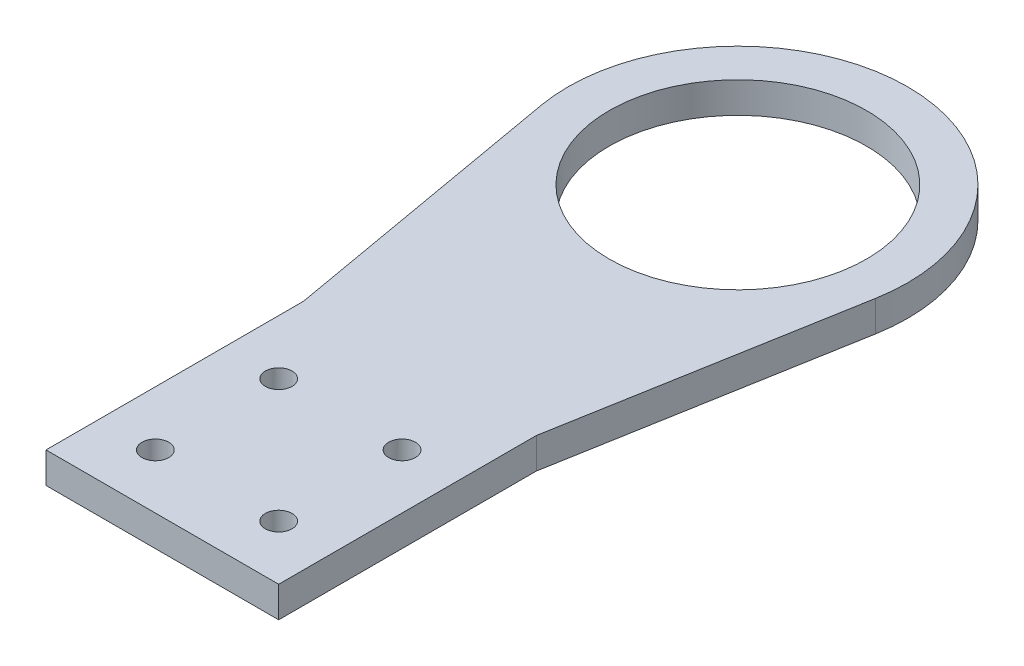
ISO-10303-21;
HEADER;
FILE_DESCRIPTION(('STEP AP214'),'2;1');
FILE_NAME('part.step','',(''),(''),'','','');
FILE_SCHEMA(('AUTOMOTIVE_DESIGN { 1 0 10303 214 1 1 1 1 }'));
ENDSEC;
DATA;
#1=APPLICATION_CONTEXT('core data for automotive mechanical design processes');
#2=APPLICATION_PROTOCOL_DEFINITION('international standard','automotive_design',2000,#1);
#3=PRODUCT_CONTEXT('',#1,'mechanical');
#4=PRODUCT('Part','Part','',(#3));
#5=PRODUCT_RELATED_PRODUCT_CATEGORY('part','',(#4));
#6=PRODUCT_DEFINITION_FORMATION('','',#4);
#7=PRODUCT_DEFINITION_CONTEXT('part definition',#1,'design');
#8=PRODUCT_DEFINITION('design','',#6,#7);
#9=PRODUCT_DEFINITION_SHAPE('','',#8);
#10=(LENGTH_UNIT() NAMED_UNIT(*) SI_UNIT(.MILLI.,.METRE.));
#11=(NAMED_UNIT(*) PLANE_ANGLE_UNIT() SI_UNIT($,.RADIAN.));
#12=(NAMED_UNIT(*) SI_UNIT($,.STERADIAN.) SOLID_ANGLE_UNIT());
#13=UNCERTAINTY_MEASURE_WITH_UNIT(LENGTH_MEASURE(1.E-05),#10,'distance_accuracy_value','');
#14=(GEOMETRIC_REPRESENTATION_CONTEXT(3) GLOBAL_UNCERTAINTY_ASSIGNED_CONTEXT((#13)) GLOBAL_UNIT_ASSIGNED_CONTEXT((#10,
#11,#12)) REPRESENTATION_CONTEXT('',''));
#15=CARTESIAN_POINT('',(0.,0.,0.));
#16=DIRECTION('',(0.,0.,1.));
#17=DIRECTION('',(1.,0.,0.));
#18=AXIS2_PLACEMENT_3D('',#15,#16,#17);
#19=CARTESIAN_POINT('',(0.,9.525,-177.8));
#20=DIRECTION('',(0.,1.,0.));
#21=DIRECTION('',(0.,0.,1.));
#22=AXIS2_PLACEMENT_3D('',#19,#20,#21);
#23=PLANE('',#22);
#24=CARTESIAN_POINT('',(19.05,9.525,-16.891));
#25=DIRECTION('',(0.,1.,0.));
#26=DIRECTION('',(0.,0.,1.));
#27=AXIS2_PLACEMENT_3D('',#24,#25,#26);
#28=CIRCLE('',#27,4.12750000000037);
#29=CARTESIAN_POINT('',(19.05,9.525,-12.7634999999996));
#30=VERTEX_POINT('',#29);
#31=EDGE_CURVE('E220',#30,#30,#28,.T.);
#32=ORIENTED_EDGE('',*,*,#31,.F.);
#33=EDGE_LOOP('',(#32));
#34=FACE_BOUND('',#33,.T.);
#35=CARTESIAN_POINT('',(-19.05,9.525,-54.991));
#36=DIRECTION('',(0.,1.,0.));
#37=DIRECTION('',(0.,0.,1.));
#38=AXIS2_PLACEMENT_3D('',#35,#36,#37);
#39=CIRCLE('',#38,4.1275);
#40=CARTESIAN_POINT('',(-19.05,9.525,-50.8635));
#41=VERTEX_POINT('',#40);
#42=EDGE_CURVE('E236',#41,#41,#39,.T.);
#43=ORIENTED_EDGE('',*,*,#42,.F.);
#44=EDGE_LOOP('',(#43));
#45=FACE_BOUND('',#44,.T.);
#46=DIRECTION('',(0.,0.,1.));
#47=VECTOR('',#46,1.);
#48=CARTESIAN_POINT('',(-35.941,9.525,0.));
#49=LINE('',#48,#47);
#50=CARTESIAN_POINT('',(-35.941,9.525,-79.578269267514));
#51=VERTEX_POINT('',#50);
#52=CARTESIAN_POINT('',(-35.941,9.525,0.));
#53=VERTEX_POINT('',#52);
#54=EDGE_CURVE('E150',#51,#53,#49,.T.);
#55=ORIENTED_EDGE('',*,*,#54,.T.);
#56=DIRECTION('',(1.,0.,0.));
#57=VECTOR('',#56,1.);
#58=CARTESIAN_POINT('',(-35.941,9.525,0.));
#59=LINE('',#58,#57);
#60=CARTESIAN_POINT('',(35.941,9.525,0.));
#61=VERTEX_POINT('',#60);
#62=EDGE_CURVE('E98',#53,#61,#59,.T.);
#63=ORIENTED_EDGE('',*,*,#62,.T.);
#64=DIRECTION('',(0.,0.,-1.));
#65=VECTOR('',#64,1.);
#66=CARTESIAN_POINT('',(35.941,9.525,0.));
#67=LINE('',#66,#65);
#68=CARTESIAN_POINT('',(35.941,9.525,-79.578269267514));
#69=VERTEX_POINT('',#68);
#70=EDGE_CURVE('E111',#61,#69,#67,.T.);
#71=ORIENTED_EDGE('',*,*,#70,.T.);
#72=DIRECTION('',(0.173648177666931,0.,-0.984807753012208));
#73=VECTOR('',#72,1.);
#74=CARTESIAN_POINT('',(35.941,9.525,-79.578269267514));
#75=LINE('',#74,#73);
#76=CARTESIAN_POINT('',(51.6541514532433,9.525,-168.691979433192));
#77=VERTEX_POINT('',#76);
#78=EDGE_CURVE('E105',#69,#77,#75,.T.);
#79=ORIENTED_EDGE('',*,*,#78,.T.);
#80=CARTESIAN_POINT('',(0.,9.525,-177.8));
#81=DIRECTION('',(0.,1.,0.));
#82=DIRECTION('',(0.,0.,1.));
#83=AXIS2_PLACEMENT_3D('',#80,#81,#82);
#84=CIRCLE('',#83,52.451);
#85=CARTESIAN_POINT('',(-51.6541514532433,9.525,-168.691979433192));
#86=VERTEX_POINT('',#85);
#87=EDGE_CURVE('E109',#77,#86,#84,.T.);
#88=ORIENTED_EDGE('',*,*,#87,.T.);
#89=DIRECTION('',(0.173648177666931,0.,0.984807753012208));
#90=VECTOR('',#89,1.);
#91=CARTESIAN_POINT('',(-35.941,9.525,-79.578269267514));
#92=LINE('',#91,#90);
#93=EDGE_CURVE('E61',#86,#51,#92,.T.);
#94=ORIENTED_EDGE('',*,*,#93,.T.);
#95=EDGE_LOOP('',(#55,#63,#71,#79,#88,#94));
#96=FACE_BOUND('',#95,.T.);
#97=CARTESIAN_POINT('',(0.,9.525,-177.8));
#98=DIRECTION('',(0.,1.,0.));
#99=DIRECTION('',(0.,0.,1.));
#100=AXIS2_PLACEMENT_3D('',#97,#98,#99);
#101=CIRCLE('',#100,39.751);
#102=CARTESIAN_POINT('',(0.,9.525,-138.049));
#103=VERTEX_POINT('',#102);
#104=EDGE_CURVE('E138',#103,#103,#101,.T.);
#105=ORIENTED_EDGE('',*,*,#104,.F.);
#106=EDGE_LOOP('',(#105));
#107=FACE_BOUND('',#106,.T.);
#108=CARTESIAN_POINT('',(19.05,9.525,-54.991));
#109=DIRECTION('',(0.,1.,0.));
#110=DIRECTION('',(0.,0.,1.));
#111=AXIS2_PLACEMENT_3D('',#108,#109,#110);
#112=CIRCLE('',#111,4.1275);
#113=CARTESIAN_POINT('',(19.05,9.525,-50.8635));
#114=VERTEX_POINT('',#113);
#115=EDGE_CURVE('E228',#114,#114,#112,.T.);
#116=ORIENTED_EDGE('',*,*,#115,.F.);
#117=EDGE_LOOP('',(#116));
#118=FACE_BOUND('',#117,.T.);
#119=CARTESIAN_POINT('',(-19.0499999999996,9.525,-16.891));
#120=DIRECTION('',(0.,1.,0.));
#121=DIRECTION('',(0.,0.,1.));
#122=AXIS2_PLACEMENT_3D('',#119,#120,#121);
#123=CIRCLE('',#122,4.1275);
#124=CARTESIAN_POINT('',(-19.0499999999996,9.525,-12.7635));
#125=VERTEX_POINT('',#124);
#126=EDGE_CURVE('E209',#125,#125,#123,.T.);
#127=ORIENTED_EDGE('',*,*,#126,.F.);
#128=EDGE_LOOP('',(#127));
#129=FACE_BOUND('',#128,.T.);
#130=ADVANCED_FACE('F43',(#34,#45,#96,#107,#118,#129),#23,.T.);
#131=CARTESIAN_POINT('',(0.,0.,-177.8));
#132=DIRECTION('',(0.,1.,0.));
#133=DIRECTION('',(0.,0.,1.));
#134=AXIS2_PLACEMENT_3D('',#131,#132,#133);
#135=PLANE('',#134);
#136=DIRECTION('',(0.,0.,1.));
#137=VECTOR('',#136,1.);
#138=CARTESIAN_POINT('',(-35.941,0.,0.));
#139=LINE('',#138,#137);
#140=CARTESIAN_POINT('',(-35.941,0.,-79.578269267514));
#141=VERTEX_POINT('',#140);
#142=CARTESIAN_POINT('',(-35.941,0.,0.));
#143=VERTEX_POINT('',#142);
#144=EDGE_CURVE('E133',#141,#143,#139,.T.);
#145=ORIENTED_EDGE('',*,*,#144,.F.);
#146=DIRECTION('',(0.173648177666931,0.,0.984807753012208));
#147=VECTOR('',#146,1.);
#148=CARTESIAN_POINT('',(-35.941,0.,-79.578269267514));
#149=LINE('',#148,#147);
#150=CARTESIAN_POINT('',(-51.6541514532433,0.,-168.691979433192));
#151=VERTEX_POINT('',#150);
#152=EDGE_CURVE('E90',#151,#141,#149,.T.);
#153=ORIENTED_EDGE('',*,*,#152,.F.);
#154=CARTESIAN_POINT('',(0.,0.,-177.8));
#155=DIRECTION('',(0.,1.,0.));
#156=DIRECTION('',(0.,0.,1.));
#157=AXIS2_PLACEMENT_3D('',#154,#155,#156);
#158=CIRCLE('',#157,52.451);
#159=CARTESIAN_POINT('',(51.6541514532433,0.,-168.691979433192));
#160=VERTEX_POINT('',#159);
#161=EDGE_CURVE('E84',#160,#151,#158,.T.);
#162=ORIENTED_EDGE('',*,*,#161,.F.);
#163=DIRECTION('',(0.173648177666931,0.,-0.984807753012208));
#164=VECTOR('',#163,1.);
#165=CARTESIAN_POINT('',(35.941,0.,-79.578269267514));
#166=LINE('',#165,#164);
#167=CARTESIAN_POINT('',(35.941,0.,-79.578269267514));
#168=VERTEX_POINT('',#167);
#169=EDGE_CURVE('E120',#168,#160,#166,.T.);
#170=ORIENTED_EDGE('',*,*,#169,.F.);
#171=DIRECTION('',(0.,0.,-1.));
#172=VECTOR('',#171,1.);
#173=CARTESIAN_POINT('',(35.941,0.,0.));
#174=LINE('',#173,#172);
#175=CARTESIAN_POINT('',(35.941,0.,0.));
#176=VERTEX_POINT('',#175);
#177=EDGE_CURVE('E141',#176,#168,#174,.T.);
#178=ORIENTED_EDGE('',*,*,#177,.F.);
#179=DIRECTION('',(1.,0.,0.));
#180=VECTOR('',#179,1.);
#181=CARTESIAN_POINT('',(-35.941,0.,0.));
#182=LINE('',#181,#180);
#183=EDGE_CURVE('E137',#143,#176,#182,.T.);
#184=ORIENTED_EDGE('',*,*,#183,.F.);
#185=EDGE_LOOP('',(#145,#153,#162,#170,#178,#184));
#186=FACE_BOUND('',#185,.T.);
#187=CARTESIAN_POINT('',(0.,0.,-177.8));
#188=DIRECTION('',(0.,1.,0.));
#189=DIRECTION('',(0.,0.,1.));
#190=AXIS2_PLACEMENT_3D('',#187,#188,#189);
#191=CIRCLE('',#190,39.751);
#192=CARTESIAN_POINT('',(0.,0.,-138.049));
#193=VERTEX_POINT('',#192);
#194=EDGE_CURVE('E240',#193,#193,#191,.T.);
#195=ORIENTED_EDGE('',*,*,#194,.T.);
#196=EDGE_LOOP('',(#195));
#197=FACE_BOUND('',#196,.T.);
#198=CARTESIAN_POINT('',(-19.05,0.,-54.991));
#199=DIRECTION('',(0.,1.,0.));
#200=DIRECTION('',(0.,0.,1.));
#201=AXIS2_PLACEMENT_3D('',#198,#199,#200);
#202=CIRCLE('',#201,4.1275);
#203=CARTESIAN_POINT('',(-19.05,0.,-50.8635));
#204=VERTEX_POINT('',#203);
#205=EDGE_CURVE('E232',#204,#204,#202,.T.);
#206=ORIENTED_EDGE('',*,*,#205,.T.);
#207=EDGE_LOOP('',(#206));
#208=FACE_BOUND('',#207,.T.);
#209=CARTESIAN_POINT('',(19.05,0.,-54.991));
#210=DIRECTION('',(0.,1.,0.));
#211=DIRECTION('',(0.,0.,1.));
#212=AXIS2_PLACEMENT_3D('',#209,#210,#211);
#213=CIRCLE('',#212,4.1275);
#214=CARTESIAN_POINT('',(19.05,0.,-50.8635));
#215=VERTEX_POINT('',#214);
#216=EDGE_CURVE('E224',#215,#215,#213,.T.);
#217=ORIENTED_EDGE('',*,*,#216,.T.);
#218=EDGE_LOOP('',(#217));
#219=FACE_BOUND('',#218,.T.);
#220=CARTESIAN_POINT('',(19.05,0.,-16.891));
#221=DIRECTION('',(0.,1.,0.));
#222=DIRECTION('',(0.,0.,1.));
#223=AXIS2_PLACEMENT_3D('',#220,#221,#222);
#224=CIRCLE('',#223,4.12750000000037);
#225=CARTESIAN_POINT('',(19.05,0.,-12.7634999999996));
#226=VERTEX_POINT('',#225);
#227=EDGE_CURVE('E217',#226,#226,#224,.T.);
#228=ORIENTED_EDGE('',*,*,#227,.T.);
#229=EDGE_LOOP('',(#228));
#230=FACE_BOUND('',#229,.T.);
#231=CARTESIAN_POINT('',(-19.0499999999996,0.,-16.891));
#232=DIRECTION('',(0.,1.,0.));
#233=DIRECTION('',(0.,0.,1.));
#234=AXIS2_PLACEMENT_3D('',#231,#232,#233);
#235=CIRCLE('',#234,4.1275);
#236=CARTESIAN_POINT('',(-19.0499999999996,0.,-12.7635));
#237=VERTEX_POINT('',#236);
#238=EDGE_CURVE('E212',#237,#237,#235,.T.);
#239=ORIENTED_EDGE('',*,*,#238,.T.);
#240=EDGE_LOOP('',(#239));
#241=FACE_BOUND('',#240,.T.);
#242=ADVANCED_FACE('F163',(#186,#197,#208,#219,#230,#241),#135,.F.);
#243=CARTESIAN_POINT('',(-35.941,9.525,0.));
#244=DIRECTION('',(1.,0.,0.));
#245=DIRECTION('',(0.,0.,-1.));
#246=AXIS2_PLACEMENT_3D('',#243,#244,#245);
#247=PLANE('',#246);
#248=ORIENTED_EDGE('',*,*,#144,.T.);
#249=DIRECTION('',(0.,-1.,0.));
#250=VECTOR('',#249,1.);
#251=CARTESIAN_POINT('',(-35.941,9.525,0.));
#252=LINE('',#251,#250);
#253=EDGE_CURVE('E11',#53,#143,#252,.T.);
#254=ORIENTED_EDGE('',*,*,#253,.F.);
#255=ORIENTED_EDGE('',*,*,#54,.F.);
#256=DIRECTION('',(0.,-1.,0.));
#257=VECTOR('',#256,1.);
#258=CARTESIAN_POINT('',(-35.941,9.525,-79.578269267514));
#259=LINE('',#258,#257);
#260=EDGE_CURVE('E129',#51,#141,#259,.T.);
#261=ORIENTED_EDGE('',*,*,#260,.T.);
#262=EDGE_LOOP('',(#248,#254,#255,#261));
#263=FACE_BOUND('',#262,.T.);
#264=ADVANCED_FACE('F45',(#263),#247,.F.);
#265=CARTESIAN_POINT('',(-35.941,9.525,0.));
#266=DIRECTION('',(0.,0.,-1.));
#267=DIRECTION('',(-1.,0.,0.));
#268=AXIS2_PLACEMENT_3D('',#265,#266,#267);
#269=PLANE('',#268);
#270=ORIENTED_EDGE('',*,*,#183,.T.);
#271=DIRECTION('',(0.,-1.,0.));
#272=VECTOR('',#271,1.);
#273=CARTESIAN_POINT('',(35.941,9.525,0.));
#274=LINE('',#273,#272);
#275=EDGE_CURVE('E53',#61,#176,#274,.T.);
#276=ORIENTED_EDGE('',*,*,#275,.F.);
#277=ORIENTED_EDGE('',*,*,#62,.F.);
#278=ORIENTED_EDGE('',*,*,#253,.T.);
#279=EDGE_LOOP('',(#270,#276,#277,#278));
#280=FACE_BOUND('',#279,.T.);
#281=ADVANCED_FACE('F317',(#280),#269,.F.);
#282=CARTESIAN_POINT('',(35.941,9.525,0.));
#283=DIRECTION('',(-1.,0.,0.));
#284=DIRECTION('',(0.,0.,1.));
#285=AXIS2_PLACEMENT_3D('',#282,#283,#284);
#286=PLANE('',#285);
#287=ORIENTED_EDGE('',*,*,#177,.T.);
#288=DIRECTION('',(0.,-1.,0.));
#289=VECTOR('',#288,1.);
#290=CARTESIAN_POINT('',(35.941,9.525,-79.578269267514));
#291=LINE('',#290,#289);
#292=EDGE_CURVE('E122',#69,#168,#291,.T.);
#293=ORIENTED_EDGE('',*,*,#292,.F.);
#294=ORIENTED_EDGE('',*,*,#70,.F.);
#295=ORIENTED_EDGE('',*,*,#275,.T.);
#296=EDGE_LOOP('',(#287,#293,#294,#295));
#297=FACE_BOUND('',#296,.T.);
#298=ADVANCED_FACE('F160',(#297),#286,.F.);
#299=CARTESIAN_POINT('',(35.941,9.525,-79.578269267514));
#300=DIRECTION('',(-0.984807753012208,0.,-0.173648177666931));
#301=DIRECTION('',(-0.173648177666931,0.,0.984807753012208));
#302=AXIS2_PLACEMENT_3D('',#299,#300,#301);
#303=PLANE('',#302);
#304=ORIENTED_EDGE('',*,*,#169,.T.);
#305=DIRECTION('',(0.,-1.,0.));
#306=VECTOR('',#305,1.);
#307=CARTESIAN_POINT('',(51.6541514532433,9.525,-168.691979433192));
#308=LINE('',#307,#306);
#309=EDGE_CURVE('E117',#77,#160,#308,.T.);
#310=ORIENTED_EDGE('',*,*,#309,.F.);
#311=ORIENTED_EDGE('',*,*,#78,.F.);
#312=ORIENTED_EDGE('',*,*,#292,.T.);
#313=EDGE_LOOP('',(#304,#310,#311,#312));
#314=FACE_BOUND('',#313,.T.);
#315=ADVANCED_FACE('F118',(#314),#303,.F.);
#316=CARTESIAN_POINT('',(0.,9.525,-177.8));
#317=DIRECTION('',(0.,-1.,0.));
#318=DIRECTION('',(0.,0.,-1.));
#319=AXIS2_PLACEMENT_3D('',#316,#317,#318);
#320=CYLINDRICAL_SURFACE('',#319,52.451);
#321=ORIENTED_EDGE('',*,*,#161,.T.);
#322=DIRECTION('',(0.,-1.,0.));
#323=VECTOR('',#322,1.);
#324=CARTESIAN_POINT('',(-51.6541514532433,9.525,-168.691979433192));
#325=LINE('',#324,#323);
#326=EDGE_CURVE('E123',#86,#151,#325,.T.);
#327=ORIENTED_EDGE('',*,*,#326,.F.);
#328=ORIENTED_EDGE('',*,*,#87,.F.);
#329=ORIENTED_EDGE('',*,*,#309,.T.);
#330=EDGE_LOOP('',(#321,#327,#328,#329));
#331=FACE_BOUND('',#330,.T.);
#332=ADVANCED_FACE('F125',(#331),#320,.T.);
#333=CARTESIAN_POINT('',(-35.941,9.525,-79.578269267514));
#334=DIRECTION('',(0.984807753012208,0.,-0.173648177666931));
#335=DIRECTION('',(-0.173648177666931,0.,-0.984807753012208));
#336=AXIS2_PLACEMENT_3D('',#333,#334,#335);
#337=PLANE('',#336);
#338=ORIENTED_EDGE('',*,*,#152,.T.);
#339=ORIENTED_EDGE('',*,*,#260,.F.);
#340=ORIENTED_EDGE('',*,*,#93,.F.);
#341=ORIENTED_EDGE('',*,*,#326,.T.);
#342=EDGE_LOOP('',(#338,#339,#340,#341));
#343=FACE_BOUND('',#342,.T.);
#344=ADVANCED_FACE('F168',(#343),#337,.F.);
#345=CARTESIAN_POINT('',(0.,9.525,-177.8));
#346=DIRECTION('',(0.,-1.,0.));
#347=DIRECTION('',(0.,0.,-1.));
#348=AXIS2_PLACEMENT_3D('',#345,#346,#347);
#349=CYLINDRICAL_SURFACE('',#348,39.751);
#350=ORIENTED_EDGE('',*,*,#104,.T.);
#351=EDGE_LOOP('',(#350));
#352=FACE_BOUND('',#351,.T.);
#353=ORIENTED_EDGE('',*,*,#194,.F.);
#354=EDGE_LOOP('',(#353));
#355=FACE_BOUND('',#354,.T.);
#356=ADVANCED_FACE('F170',(#352,#355),#349,.F.);
#357=CARTESIAN_POINT('',(-19.05,9.525,-54.991));
#358=DIRECTION('',(0.,-1.,0.));
#359=DIRECTION('',(0.,0.,-1.));
#360=AXIS2_PLACEMENT_3D('',#357,#358,#359);
#361=CYLINDRICAL_SURFACE('',#360,4.1275);
#362=ORIENTED_EDGE('',*,*,#42,.T.);
#363=EDGE_LOOP('',(#362));
#364=FACE_BOUND('',#363,.T.);
#365=ORIENTED_EDGE('',*,*,#205,.F.);
#366=EDGE_LOOP('',(#365));
#367=FACE_BOUND('',#366,.T.);
#368=ADVANCED_FACE('F176',(#364,#367),#361,.F.);
#369=CARTESIAN_POINT('',(19.05,9.525,-54.991));
#370=DIRECTION('',(0.,-1.,0.));
#371=DIRECTION('',(0.,0.,-1.));
#372=AXIS2_PLACEMENT_3D('',#369,#370,#371);
#373=CYLINDRICAL_SURFACE('',#372,4.1275);
#374=ORIENTED_EDGE('',*,*,#115,.T.);
#375=EDGE_LOOP('',(#374));
#376=FACE_BOUND('',#375,.T.);
#377=ORIENTED_EDGE('',*,*,#216,.F.);
#378=EDGE_LOOP('',(#377));
#379=FACE_BOUND('',#378,.T.);
#380=ADVANCED_FACE('F192',(#376,#379),#373,.F.);
#381=CARTESIAN_POINT('',(19.05,9.525,-16.891));
#382=DIRECTION('',(0.,-1.,0.));
#383=DIRECTION('',(0.,0.,-1.));
#384=AXIS2_PLACEMENT_3D('',#381,#382,#383);
#385=CYLINDRICAL_SURFACE('',#384,4.12750000000037);
#386=ORIENTED_EDGE('',*,*,#31,.T.);
#387=EDGE_LOOP('',(#386));
#388=FACE_BOUND('',#387,.T.);
#389=ORIENTED_EDGE('',*,*,#227,.F.);
#390=EDGE_LOOP('',(#389));
#391=FACE_BOUND('',#390,.T.);
#392=ADVANCED_FACE('F196',(#388,#391),#385,.F.);
#393=CARTESIAN_POINT('',(-19.0499999999996,9.525,-16.891));
#394=DIRECTION('',(0.,-1.,0.));
#395=DIRECTION('',(0.,0.,-1.));
#396=AXIS2_PLACEMENT_3D('',#393,#394,#395);
#397=CYLINDRICAL_SURFACE('',#396,4.1275);
#398=ORIENTED_EDGE('',*,*,#126,.T.);
#399=EDGE_LOOP('',(#398));
#400=FACE_BOUND('',#399,.T.);
#401=ORIENTED_EDGE('',*,*,#238,.F.);
#402=EDGE_LOOP('',(#401));
#403=FACE_BOUND('',#402,.T.);
#404=ADVANCED_FACE('F200',(#400,#403),#397,.F.);
#405=CLOSED_SHELL('',(#130,#242,#264,#281,#298,#315,#332,#344,#356,#368,#380,#392,#404));
#406=MANIFOLD_SOLID_BREP('B2',#405);
#407=ADVANCED_BREP_SHAPE_REPRESENTATION('',(#18,#406),#14);
#408=SHAPE_DEFINITION_REPRESENTATION(#9,#407);
ENDSEC;
END-ISO-10303-21;
